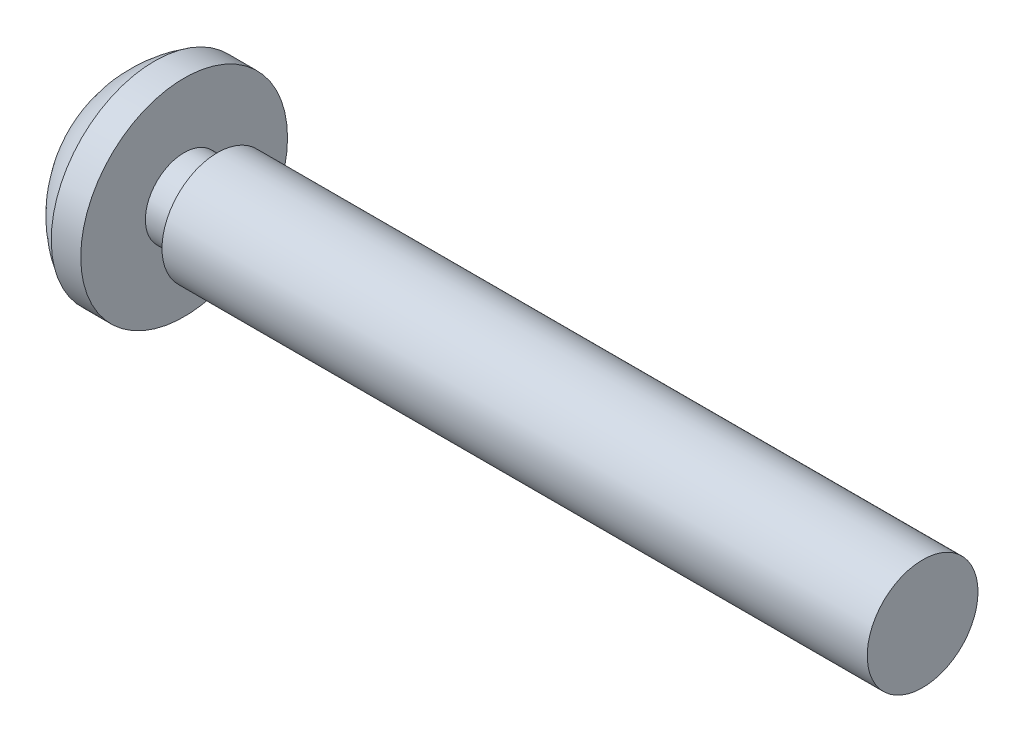
ISO-10303-21;
HEADER;
FILE_DESCRIPTION(('STEP AP214'),'2;1');
FILE_NAME('part.step','',(''),(''),'','','');
FILE_SCHEMA(('AUTOMOTIVE_DESIGN { 1 0 10303 214 1 1 1 1 }'));
ENDSEC;
DATA;
#1=APPLICATION_CONTEXT('core data for automotive mechanical design processes');
#2=APPLICATION_PROTOCOL_DEFINITION('international standard','automotive_design',2000,#1);
#3=PRODUCT_CONTEXT('',#1,'mechanical');
#4=PRODUCT('Part','Part','',(#3));
#5=PRODUCT_RELATED_PRODUCT_CATEGORY('part','',(#4));
#6=PRODUCT_DEFINITION_FORMATION('','',#4);
#7=PRODUCT_DEFINITION_CONTEXT('part definition',#1,'design');
#8=PRODUCT_DEFINITION('design','',#6,#7);
#9=PRODUCT_DEFINITION_SHAPE('','',#8);
#10=(LENGTH_UNIT() NAMED_UNIT(*) SI_UNIT(.MILLI.,.METRE.));
#11=(NAMED_UNIT(*) PLANE_ANGLE_UNIT() SI_UNIT($,.RADIAN.));
#12=(NAMED_UNIT(*) SI_UNIT($,.STERADIAN.) SOLID_ANGLE_UNIT());
#13=UNCERTAINTY_MEASURE_WITH_UNIT(LENGTH_MEASURE(1.E-05),#10,'distance_accuracy_value','');
#14=(GEOMETRIC_REPRESENTATION_CONTEXT(3) GLOBAL_UNCERTAINTY_ASSIGNED_CONTEXT((#13)) GLOBAL_UNIT_ASSIGNED_CONTEXT((#10,
#11,#12)) REPRESENTATION_CONTEXT('',''));
#15=CARTESIAN_POINT('',(0.,0.,0.));
#16=DIRECTION('',(0.,0.,1.));
#17=DIRECTION('',(1.,0.,0.));
#18=AXIS2_PLACEMENT_3D('',#15,#16,#17);
#19=CARTESIAN_POINT('',(-19.15,0.,0.));
#20=DIRECTION('',(1.,0.,0.));
#21=DIRECTION('',(0.,1.,0.));
#22=AXIS2_PLACEMENT_3D('',#19,#20,#21);
#23=SPHERICAL_SURFACE('',#22,3.25);
#24=CARTESIAN_POINT('',(-20.8,0.,0.));
#25=DIRECTION('',(1.,0.,0.));
#26=DIRECTION('',(0.,0.,-1.));
#27=AXIS2_PLACEMENT_3D('',#24,#25,#26);
#28=CIRCLE('',#27,2.8);
#29=CARTESIAN_POINT('',(-20.8,0.,-2.8));
#30=VERTEX_POINT('',#29);
#31=EDGE_CURVE('E172',#30,#30,#28,.T.);
#32=ORIENTED_EDGE('',*,*,#31,.F.);
#33=EDGE_LOOP('',(#32));
#34=FACE_BOUND('',#33,.T.);
#35=CARTESIAN_POINT('',(-22.3068940289468,0.375000066666674,-0.675199999999999));
#36=CARTESIAN_POINT('',(-22.31039538603,0.374974039787709,-0.658850385121531));
#37=CARTESIAN_POINT('',(-22.3136133722107,0.37631432389268,-0.642432860727959));
#38=CARTESIAN_POINT('',(-22.3193993644706,0.381684853078188,-0.609919694568042));
#39=CARTESIAN_POINT('',(-22.3219670797919,0.385716298547903,-0.593824199743856));
#40=CARTESIAN_POINT('',(-22.3263691557337,0.396434080962598,-0.562405806208291));
#41=CARTESIAN_POINT('',(-22.3282024640236,0.40312420038652,-0.547084043435579));
#42=CARTESIAN_POINT('',(-22.3310682853566,0.418991926287625,-0.517716698727841));
#43=CARTESIAN_POINT('',(-22.3321013161393,0.428167919333055,-0.503670296900031));
#44=CARTESIAN_POINT('',(-22.333317814792,0.448514526561983,-0.477587734148935));
#45=CARTESIAN_POINT('',(-22.3335204359993,0.459633928169651,-0.465512496825722));
#46=CARTESIAN_POINT('',(-22.3331219469987,0.483685195957618,-0.443340514979258));
#47=CARTESIAN_POINT('',(-22.3325207910735,0.496617165195829,-0.43324388303273));
#48=CARTESIAN_POINT('',(-22.3305465495203,0.52375198188587,-0.415414384530053));
#49=CARTESIAN_POINT('',(-22.3291823028179,0.53793873877994,-0.407655989689832));
#50=CARTESIAN_POINT('',(-22.3257316366459,0.567301133586124,-0.39453703708237));
#51=CARTESIAN_POINT('',(-22.3236451638736,0.582476844419147,-0.389176656363358));
#52=CARTESIAN_POINT('',(-22.3192512828636,0.610594589490666,-0.381701859125301));
#53=CARTESIAN_POINT('',(-22.317051373952,0.623446563005218,-0.379176670553307));
#54=CARTESIAN_POINT('',(-22.3122574783827,0.649278469056087,-0.375820322941036));
#55=CARTESIAN_POINT('',(-22.3096640610531,0.662258191795707,-0.37498674113212));
#56=CARTESIAN_POINT('',(-22.3068940289468,0.675199999999999,-0.375000066666674));
#57=B_SPLINE_CURVE_WITH_KNOTS('',3,(#35,#36,#37,#38,#39,#40,#41,#42,#43,#44,#45,#46,#47,#48,#49,
#50,#51,#52,#53,#54,#55,#56),.UNSPECIFIED.,.F.,.F.,(4,2,2,2,2,2,2,2,2,2,4),(0.,
0.0501133292441571,0.100249026425948,0.150456308180251,0.20063108114174,0.249641830902457,
0.298655368418994,0.347112597227158,0.395573403099858,0.435304823461775,0.474979299046477),.UNSPECIFIED.);
#58=CARTESIAN_POINT('',(-22.3069368064629,0.375,-0.675));
#59=VERTEX_POINT('',#58);
#60=CARTESIAN_POINT('',(-22.3069368064629,0.675,-0.375));
#61=VERTEX_POINT('',#60);
#62=EDGE_CURVE('E205',#59,#61,#57,.T.);
#63=ORIENTED_EDGE('',*,*,#62,.T.);
#64=CARTESIAN_POINT('',(-19.15,0.,-0.375));
#65=DIRECTION('',(0.,0.,1.));
#66=DIRECTION('',(1.,0.,0.));
#67=AXIS2_PLACEMENT_3D('',#64,#65,#66);
#68=CIRCLE('',#67,3.22829289253624);
#69=CARTESIAN_POINT('',(-21.8299020504489,1.8,-0.375));
#70=VERTEX_POINT('',#69);
#71=EDGE_CURVE('E11',#61,#70,#68,.F.);
#72=ORIENTED_EDGE('',*,*,#71,.T.);
#73=CARTESIAN_POINT('',(-19.15,1.8,0.));
#74=DIRECTION('',(0.,-1.,0.));
#75=DIRECTION('',(0.,0.,-1.));
#76=AXIS2_PLACEMENT_3D('',#73,#74,#75);
#77=CIRCLE('',#76,2.70601182554696);
#78=CARTESIAN_POINT('',(-21.8299020504489,1.8,0.375));
#79=VERTEX_POINT('',#78);
#80=EDGE_CURVE('E49',#70,#79,#77,.F.);
#81=ORIENTED_EDGE('',*,*,#80,.T.);
#82=CARTESIAN_POINT('',(-19.15,0.,0.375));
#83=DIRECTION('',(0.,0.,-1.));
#84=DIRECTION('',(0.,1.,0.));
#85=AXIS2_PLACEMENT_3D('',#82,#83,#84);
#86=CIRCLE('',#85,3.22829289253624);
#87=CARTESIAN_POINT('',(-22.3069368064629,0.675,0.375));
#88=VERTEX_POINT('',#87);
#89=EDGE_CURVE('E314',#79,#88,#86,.F.);
#90=ORIENTED_EDGE('',*,*,#89,.T.);
#91=CARTESIAN_POINT('',(-22.3068940289468,0.675199999999999,0.375000066666674));
#92=CARTESIAN_POINT('',(-22.31039538603,0.658850385121531,0.374974039787708));
#93=CARTESIAN_POINT('',(-22.3136133722107,0.642432860727959,0.37631432389268));
#94=CARTESIAN_POINT('',(-22.3193993644706,0.609919694568042,0.381684853078188));
#95=CARTESIAN_POINT('',(-22.3219670797919,0.593824199743856,0.385716298547903));
#96=CARTESIAN_POINT('',(-22.3263691557337,0.562405806208291,0.396434080962598));
#97=CARTESIAN_POINT('',(-22.3282024640236,0.547084043435579,0.403124200386519));
#98=CARTESIAN_POINT('',(-22.3310682853566,0.517716698727841,0.418991926287625));
#99=CARTESIAN_POINT('',(-22.3321013161393,0.503670296900031,0.428167919333055));
#100=CARTESIAN_POINT('',(-22.333317814792,0.477587734148935,0.448514526561983));
#101=CARTESIAN_POINT('',(-22.3335204359993,0.465512496825722,0.45963392816965));
#102=CARTESIAN_POINT('',(-22.3331219469987,0.443340514979258,0.483685195957618));
#103=CARTESIAN_POINT('',(-22.3325207910735,0.43324388303273,0.496617165195829));
#104=CARTESIAN_POINT('',(-22.3305465495203,0.415414384530053,0.52375198188587));
#105=CARTESIAN_POINT('',(-22.3291823028179,0.407655989689833,0.537938738779939));
#106=CARTESIAN_POINT('',(-22.3257316366459,0.394537037082369,0.567301133586124));
#107=CARTESIAN_POINT('',(-22.3236451638736,0.389176656363358,0.582476844419147));
#108=CARTESIAN_POINT('',(-22.3192512828636,0.381701859125301,0.610594589490666));
#109=CARTESIAN_POINT('',(-22.317051373952,0.379176670553307,0.623446563005218));
#110=CARTESIAN_POINT('',(-22.3122574783827,0.375820322941036,0.649278469056086));
#111=CARTESIAN_POINT('',(-22.3096640610531,0.37498674113212,0.662258191795707));
#112=CARTESIAN_POINT('',(-22.3068940289468,0.375000066666674,0.675199999999999));
#113=B_SPLINE_CURVE_WITH_KNOTS('',3,(#91,#92,#93,#94,#95,#96,#97,#98,#99,#100,#101,#102,#103,
#104,#105,#106,#107,#108,#109,#110,#111,#112),.UNSPECIFIED.,.F.,.F.,(4,2,2,2,2,2,2,2,2,2,4),(0.,
0.0501133292441573,0.100249026425948,0.150456308180251,0.20063108114174,0.249641830902457,
0.298655368418994,0.347112597227158,0.395573403099857,0.435304823461775,0.474979299046478),.UNSPECIFIED.);
#114=CARTESIAN_POINT('',(-22.3069368064629,0.375,0.675));
#115=VERTEX_POINT('',#114);
#116=EDGE_CURVE('E305',#88,#115,#113,.T.);
#117=ORIENTED_EDGE('',*,*,#116,.T.);
#118=CARTESIAN_POINT('',(-19.15,0.375,0.));
#119=DIRECTION('',(0.,-1.,0.));
#120=DIRECTION('',(0.,0.,-1.));
#121=AXIS2_PLACEMENT_3D('',#118,#119,#120);
#122=CIRCLE('',#121,3.22829289253624);
#123=CARTESIAN_POINT('',(-21.8299020504489,0.375,1.8));
#124=VERTEX_POINT('',#123);
#125=EDGE_CURVE('E315',#115,#124,#122,.F.);
#126=ORIENTED_EDGE('',*,*,#125,.T.);
#127=CARTESIAN_POINT('',(-19.15,0.,1.8));
#128=DIRECTION('',(0.,0.,-1.));
#129=DIRECTION('',(-1.,0.,0.));
#130=AXIS2_PLACEMENT_3D('',#127,#128,#129);
#131=CIRCLE('',#130,2.70601182554696);
#132=CARTESIAN_POINT('',(-21.8299020504489,-0.375,1.8));
#133=VERTEX_POINT('',#132);
#134=EDGE_CURVE('E435',#124,#133,#131,.F.);
#135=ORIENTED_EDGE('',*,*,#134,.T.);
#136=CARTESIAN_POINT('',(-19.15,-0.375,0.));
#137=DIRECTION('',(0.,1.,0.));
#138=DIRECTION('',(0.,0.,1.));
#139=AXIS2_PLACEMENT_3D('',#136,#137,#138);
#140=CIRCLE('',#139,3.22829289253624);
#141=CARTESIAN_POINT('',(-22.3069368064629,-0.375,0.675));
#142=VERTEX_POINT('',#141);
#143=EDGE_CURVE('E276',#133,#142,#140,.F.);
#144=ORIENTED_EDGE('',*,*,#143,.T.);
#145=CARTESIAN_POINT('',(-22.3068940289468,-0.375000066666674,0.675199999999999));
#146=CARTESIAN_POINT('',(-22.31039538603,-0.374974039787708,0.658850385121531));
#147=CARTESIAN_POINT('',(-22.3136133722107,-0.37631432389268,0.64243286072796));
#148=CARTESIAN_POINT('',(-22.3193993644706,-0.381684853078188,0.609919694568042));
#149=CARTESIAN_POINT('',(-22.3219670797919,-0.385716298547903,0.593824199743856));
#150=CARTESIAN_POINT('',(-22.3263691557337,-0.396434080962598,0.562405806208291));
#151=CARTESIAN_POINT('',(-22.3282024640236,-0.403124200386519,0.547084043435579));
#152=CARTESIAN_POINT('',(-22.3310682853566,-0.418991926287625,0.517716698727841));
#153=CARTESIAN_POINT('',(-22.3321013161393,-0.428167919333055,0.503670296900031));
#154=CARTESIAN_POINT('',(-22.333317814792,-0.448514526561982,0.477587734148936));
#155=CARTESIAN_POINT('',(-22.3335204359993,-0.45963392816965,0.465512496825722));
#156=CARTESIAN_POINT('',(-22.3331219469987,-0.483685195957618,0.443340514979258));
#157=CARTESIAN_POINT('',(-22.3325207910735,-0.496617165195828,0.43324388303273));
#158=CARTESIAN_POINT('',(-22.3305465495203,-0.52375198188587,0.415414384530054));
#159=CARTESIAN_POINT('',(-22.3291823028179,-0.537938738779939,0.407655989689833));
#160=CARTESIAN_POINT('',(-22.3257316366459,-0.567301133586124,0.394537037082369));
#161=CARTESIAN_POINT('',(-22.3236451638736,-0.582476844419147,0.389176656363358));
#162=CARTESIAN_POINT('',(-22.3192512828636,-0.610594589490666,0.381701859125301));
#163=CARTESIAN_POINT('',(-22.317051373952,-0.623446563005218,0.379176670553306));
#164=CARTESIAN_POINT('',(-22.3122574783827,-0.649278469056087,0.375820322941036));
#165=CARTESIAN_POINT('',(-22.3096640610531,-0.662258191795707,0.37498674113212));
#166=CARTESIAN_POINT('',(-22.3068940289468,-0.675199999999999,0.375000066666674));
#167=B_SPLINE_CURVE_WITH_KNOTS('',3,(#145,#146,#147,#148,#149,#150,#151,#152,#153,#154,#155,
#156,#157,#158,#159,#160,#161,#162,#163,#164,#165,#166),.UNSPECIFIED.,.F.,.F.,(4,2,2,2,2,2,2,2,
2,2,4),(0.,0.050113329244157,0.100249026425948,0.150456308180251,0.200631081141739,
0.249641830902456,0.298655368418994,0.347112597227158,0.395573403099857,0.435304823461776,
0.474979299046479),.UNSPECIFIED.);
#168=CARTESIAN_POINT('',(-22.3069368064629,-0.675,0.375));
#169=VERTEX_POINT('',#168);
#170=EDGE_CURVE('E267',#142,#169,#167,.T.);
#171=ORIENTED_EDGE('',*,*,#170,.T.);
#172=CARTESIAN_POINT('',(-19.15,0.,0.375));
#173=DIRECTION('',(0.,0.,-1.));
#174=DIRECTION('',(-1.,0.,0.));
#175=AXIS2_PLACEMENT_3D('',#172,#173,#174);
#176=CIRCLE('',#175,3.22829289253624);
#177=CARTESIAN_POINT('',(-21.8299020504489,-1.8,0.375));
#178=VERTEX_POINT('',#177);
#179=EDGE_CURVE('E263',#169,#178,#176,.F.);
#180=ORIENTED_EDGE('',*,*,#179,.T.);
#181=CARTESIAN_POINT('',(-19.15,-1.8,0.));
#182=DIRECTION('',(0.,1.,0.));
#183=DIRECTION('',(0.,0.,1.));
#184=AXIS2_PLACEMENT_3D('',#181,#182,#183);
#185=CIRCLE('',#184,2.70601182554696);
#186=CARTESIAN_POINT('',(-21.8299020504489,-1.8,-0.375));
#187=VERTEX_POINT('',#186);
#188=EDGE_CURVE('E259',#178,#187,#185,.F.);
#189=ORIENTED_EDGE('',*,*,#188,.T.);
#190=CARTESIAN_POINT('',(-19.15,0.,-0.375));
#191=DIRECTION('',(0.,0.,1.));
#192=DIRECTION('',(0.,-1.,0.));
#193=AXIS2_PLACEMENT_3D('',#190,#191,#192);
#194=CIRCLE('',#193,3.22829289253624);
#195=CARTESIAN_POINT('',(-22.3069368064629,-0.675,-0.375));
#196=VERTEX_POINT('',#195);
#197=EDGE_CURVE('E254',#187,#196,#194,.F.);
#198=ORIENTED_EDGE('',*,*,#197,.T.);
#199=CARTESIAN_POINT('',(-22.3068940289468,-0.675199999999999,-0.375000066666674));
#200=CARTESIAN_POINT('',(-22.31039538603,-0.658850385121532,-0.374974039787709));
#201=CARTESIAN_POINT('',(-22.3136133722107,-0.64243286072796,-0.37631432389268));
#202=CARTESIAN_POINT('',(-22.3193993644706,-0.609919694568042,-0.381684853078188));
#203=CARTESIAN_POINT('',(-22.3219670797919,-0.593824199743856,-0.385716298547903));
#204=CARTESIAN_POINT('',(-22.3263691557337,-0.562405806208292,-0.396434080962598));
#205=CARTESIAN_POINT('',(-22.3282024640236,-0.547084043435579,-0.403124200386519));
#206=CARTESIAN_POINT('',(-22.3310682853566,-0.517716698727842,-0.418991926287625));
#207=CARTESIAN_POINT('',(-22.3321013161393,-0.503670296900031,-0.428167919333055));
#208=CARTESIAN_POINT('',(-22.333317814792,-0.477587734148936,-0.448514526561982));
#209=CARTESIAN_POINT('',(-22.3335204359993,-0.465512496825722,-0.45963392816965));
#210=CARTESIAN_POINT('',(-22.3331219469987,-0.443340514979258,-0.483685195957618));
#211=CARTESIAN_POINT('',(-22.3325207910735,-0.43324388303273,-0.496617165195828));
#212=CARTESIAN_POINT('',(-22.3305465495203,-0.415414384530054,-0.52375198188587));
#213=CARTESIAN_POINT('',(-22.3291823028179,-0.407655989689833,-0.537938738779939));
#214=CARTESIAN_POINT('',(-22.3257316366459,-0.39453703708237,-0.567301133586124));
#215=CARTESIAN_POINT('',(-22.3236451638736,-0.389176656363358,-0.582476844419147));
#216=CARTESIAN_POINT('',(-22.3192512828636,-0.381701859125301,-0.610594589490666));
#217=CARTESIAN_POINT('',(-22.317051373952,-0.379176670553307,-0.623446563005217));
#218=CARTESIAN_POINT('',(-22.3122574783827,-0.375820322941036,-0.649278469056087));
#219=CARTESIAN_POINT('',(-22.3096640610531,-0.37498674113212,-0.662258191795707));
#220=CARTESIAN_POINT('',(-22.3068940289468,-0.375000066666674,-0.675199999999999));
#221=B_SPLINE_CURVE_WITH_KNOTS('',3,(#199,#200,#201,#202,#203,#204,#205,#206,#207,#208,#209,
#210,#211,#212,#213,#214,#215,#216,#217,#218,#219,#220),.UNSPECIFIED.,.F.,.F.,(4,2,2,2,2,2,2,2,
2,2,4),(0.,0.0501133292441569,0.100249026425948,0.150456308180251,0.200631081141739,
0.249641830902456,0.298655368418994,0.347112597227158,0.395573403099857,0.435304823461775,
0.474979299046478),.UNSPECIFIED.);
#222=CARTESIAN_POINT('',(-22.3069368064629,-0.375,-0.675));
#223=VERTEX_POINT('',#222);
#224=EDGE_CURVE('E245',#196,#223,#221,.T.);
#225=ORIENTED_EDGE('',*,*,#224,.T.);
#226=CARTESIAN_POINT('',(-19.15,-0.375,0.));
#227=DIRECTION('',(0.,1.,0.));
#228=DIRECTION('',(0.,0.,1.));
#229=AXIS2_PLACEMENT_3D('',#226,#227,#228);
#230=CIRCLE('',#229,3.22829289253624);
#231=CARTESIAN_POINT('',(-21.8299020504489,-0.375,-1.8));
#232=VERTEX_POINT('',#231);
#233=EDGE_CURVE('E255',#223,#232,#230,.F.);
#234=ORIENTED_EDGE('',*,*,#233,.T.);
#235=CARTESIAN_POINT('',(-19.15,0.,-1.8));
#236=DIRECTION('',(0.,0.,1.));
#237=DIRECTION('',(1.,0.,0.));
#238=AXIS2_PLACEMENT_3D('',#235,#236,#237);
#239=CIRCLE('',#238,2.70601182554696);
#240=CARTESIAN_POINT('',(-21.8299020504489,0.375,-1.8));
#241=VERTEX_POINT('',#240);
#242=EDGE_CURVE('E428',#232,#241,#239,.F.);
#243=ORIENTED_EDGE('',*,*,#242,.T.);
#244=CARTESIAN_POINT('',(-19.15,0.375,0.));
#245=DIRECTION('',(0.,-1.,0.));
#246=DIRECTION('',(0.,0.,-1.));
#247=AXIS2_PLACEMENT_3D('',#244,#245,#246);
#248=CIRCLE('',#247,3.22829289253624);
#249=EDGE_CURVE('E215',#241,#59,#248,.F.);
#250=ORIENTED_EDGE('',*,*,#249,.T.);
#251=EDGE_LOOP('',(#63,#72,#81,#90,#117,#126,#135,#144,#171,#180,#189,#198,#225,#234,#243,#250));
#252=FACE_BOUND('',#251,.T.);
#253=ADVANCED_FACE('F40',(#34,#252),#23,.T.);
#254=CARTESIAN_POINT('',(0.,0.,0.));
#255=DIRECTION('',(1.,0.,0.));
#256=DIRECTION('',(0.,0.,-1.));
#257=AXIS2_PLACEMENT_3D('',#254,#255,#256);
#258=PLANE('',#257);
#259=CARTESIAN_POINT('',(0.,0.,0.));
#260=DIRECTION('',(1.,0.,0.));
#261=DIRECTION('',(0.,0.,-1.));
#262=AXIS2_PLACEMENT_3D('',#259,#260,#261);
#263=CIRCLE('',#262,1.5);
#264=CARTESIAN_POINT('',(0.,0.,-1.5));
#265=VERTEX_POINT('',#264);
#266=EDGE_CURVE('E201',#265,#265,#263,.T.);
#267=ORIENTED_EDGE('',*,*,#266,.T.);
#268=EDGE_LOOP('',(#267));
#269=FACE_BOUND('',#268,.T.);
#270=ADVANCED_FACE('F42',(#269),#258,.T.);
#271=CARTESIAN_POINT('',(0.,0.,0.));
#272=DIRECTION('',(1.,0.,0.));
#273=DIRECTION('',(0.,0.,-1.));
#274=AXIS2_PLACEMENT_3D('',#271,#272,#273);
#275=CYLINDRICAL_SURFACE('',#274,1.5);
#276=CARTESIAN_POINT('',(-19.1,0.,0.));
#277=DIRECTION('',(1.,0.,0.));
#278=DIRECTION('',(0.,0.,-1.));
#279=AXIS2_PLACEMENT_3D('',#276,#277,#278);
#280=CIRCLE('',#279,1.5);
#281=CARTESIAN_POINT('',(-19.1,0.,-1.5));
#282=VERTEX_POINT('',#281);
#283=EDGE_CURVE('E197',#282,#282,#280,.T.);
#284=ORIENTED_EDGE('',*,*,#283,.T.);
#285=EDGE_LOOP('',(#284));
#286=FACE_BOUND('',#285,.T.);
#287=ORIENTED_EDGE('',*,*,#266,.F.);
#288=EDGE_LOOP('',(#287));
#289=FACE_BOUND('',#288,.T.);
#290=ADVANCED_FACE('F463',(#286,#289),#275,.T.);
#291=CARTESIAN_POINT('',(-19.1,1.5,0.));
#292=DIRECTION('',(-1.,0.,0.));
#293=DIRECTION('',(0.,0.,1.));
#294=AXIS2_PLACEMENT_3D('',#291,#292,#293);
#295=PLANE('',#294);
#296=CARTESIAN_POINT('',(-19.1,0.,0.));
#297=DIRECTION('',(1.,0.,0.));
#298=DIRECTION('',(0.,0.,-1.));
#299=AXIS2_PLACEMENT_3D('',#296,#297,#298);
#300=CIRCLE('',#299,1.05);
#301=CARTESIAN_POINT('',(-19.1,0.,-1.05));
#302=VERTEX_POINT('',#301);
#303=EDGE_CURVE('E193',#302,#302,#300,.T.);
#304=ORIENTED_EDGE('',*,*,#303,.T.);
#305=EDGE_LOOP('',(#304));
#306=FACE_BOUND('',#305,.T.);
#307=ORIENTED_EDGE('',*,*,#283,.F.);
#308=EDGE_LOOP('',(#307));
#309=FACE_BOUND('',#308,.T.);
#310=ADVANCED_FACE('F481',(#306,#309),#295,.T.);
#311=CARTESIAN_POINT('',(0.,0.,0.));
#312=DIRECTION('',(1.,0.,0.));
#313=DIRECTION('',(0.,0.,-1.));
#314=AXIS2_PLACEMENT_3D('',#311,#312,#313);
#315=CYLINDRICAL_SURFACE('',#314,1.05);
#316=CARTESIAN_POINT('',(-20.,0.,0.));
#317=DIRECTION('',(1.,0.,0.));
#318=DIRECTION('',(0.,0.,-1.));
#319=AXIS2_PLACEMENT_3D('',#316,#317,#318);
#320=CIRCLE('',#319,1.05);
#321=CARTESIAN_POINT('',(-20.,0.,-1.05));
#322=VERTEX_POINT('',#321);
#323=EDGE_CURVE('E189',#322,#322,#320,.T.);
#324=ORIENTED_EDGE('',*,*,#323,.T.);
#325=EDGE_LOOP('',(#324));
#326=FACE_BOUND('',#325,.T.);
#327=ORIENTED_EDGE('',*,*,#303,.F.);
#328=EDGE_LOOP('',(#327));
#329=FACE_BOUND('',#328,.T.);
#330=ADVANCED_FACE('F475',(#326,#329),#315,.T.);
#331=CARTESIAN_POINT('',(-20.,1.05,0.));
#332=DIRECTION('',(1.,0.,0.));
#333=DIRECTION('',(0.,0.,-1.));
#334=AXIS2_PLACEMENT_3D('',#331,#332,#333);
#335=PLANE('',#334);
#336=CARTESIAN_POINT('',(-20.,0.,0.));
#337=DIRECTION('',(1.,0.,0.));
#338=DIRECTION('',(0.,0.,-1.));
#339=AXIS2_PLACEMENT_3D('',#336,#337,#338);
#340=CIRCLE('',#339,2.8);
#341=CARTESIAN_POINT('',(-20.,0.,-2.8));
#342=VERTEX_POINT('',#341);
#343=EDGE_CURVE('E179',#342,#342,#340,.T.);
#344=ORIENTED_EDGE('',*,*,#343,.T.);
#345=EDGE_LOOP('',(#344));
#346=FACE_BOUND('',#345,.T.);
#347=ORIENTED_EDGE('',*,*,#323,.F.);
#348=EDGE_LOOP('',(#347));
#349=FACE_BOUND('',#348,.T.);
#350=ADVANCED_FACE('F470',(#346,#349),#335,.T.);
#351=CARTESIAN_POINT('',(0.,0.,0.));
#352=DIRECTION('',(1.,0.,0.));
#353=DIRECTION('',(0.,0.,-1.));
#354=AXIS2_PLACEMENT_3D('',#351,#352,#353);
#355=CYLINDRICAL_SURFACE('',#354,2.8);
#356=ORIENTED_EDGE('',*,*,#31,.T.);
#357=EDGE_LOOP('',(#356));
#358=FACE_BOUND('',#357,.T.);
#359=ORIENTED_EDGE('',*,*,#343,.F.);
#360=EDGE_LOOP('',(#359));
#361=FACE_BOUND('',#360,.T.);
#362=ADVANCED_FACE('F467',(#358,#361),#355,.T.);
#363=CARTESIAN_POINT('',(-21.2,1.8,-0.375));
#364=DIRECTION('',(0.,0.,1.));
#365=DIRECTION('',(1.,0.,0.));
#366=AXIS2_PLACEMENT_3D('',#363,#364,#365);
#367=PLANE('',#366);
#368=DIRECTION('',(-1.,0.,0.));
#369=VECTOR('',#368,1.);
#370=CARTESIAN_POINT('',(-21.2,0.675,-0.375));
#371=LINE('',#370,#369);
#372=CARTESIAN_POINT('',(-21.2,0.675,-0.375));
#373=VERTEX_POINT('',#372);
#374=EDGE_CURVE('E56',#373,#61,#371,.T.);
#375=ORIENTED_EDGE('',*,*,#374,.F.);
#376=DIRECTION('',(0.,1.,0.));
#377=VECTOR('',#376,1.);
#378=CARTESIAN_POINT('',(-21.2,1.8,-0.375));
#379=LINE('',#378,#377);
#380=CARTESIAN_POINT('',(-21.2,1.8,-0.375));
#381=VERTEX_POINT('',#380);
#382=EDGE_CURVE('E159',#373,#381,#379,.T.);
#383=ORIENTED_EDGE('',*,*,#382,.T.);
#384=DIRECTION('',(-1.,0.,0.));
#385=VECTOR('',#384,1.);
#386=CARTESIAN_POINT('',(-21.2,1.8,-0.375));
#387=LINE('',#386,#385);
#388=EDGE_CURVE('E167',#381,#70,#387,.T.);
#389=ORIENTED_EDGE('',*,*,#388,.T.);
#390=ORIENTED_EDGE('',*,*,#71,.F.);
#391=EDGE_LOOP('',(#375,#383,#389,#390));
#392=FACE_BOUND('',#391,.T.);
#393=ADVANCED_FACE('F166',(#392),#367,.T.);
#394=CARTESIAN_POINT('',(-21.2,1.8,-0.375));
#395=DIRECTION('',(0.,-1.,0.));
#396=DIRECTION('',(0.,0.,-1.));
#397=AXIS2_PLACEMENT_3D('',#394,#395,#396);
#398=PLANE('',#397);
#399=ORIENTED_EDGE('',*,*,#388,.F.);
#400=DIRECTION('',(0.,0.,1.));
#401=VECTOR('',#400,1.);
#402=CARTESIAN_POINT('',(-21.2,1.8,-0.375));
#403=LINE('',#402,#401);
#404=CARTESIAN_POINT('',(-21.2,1.8,0.375));
#405=VERTEX_POINT('',#404);
#406=EDGE_CURVE('E155',#381,#405,#403,.T.);
#407=ORIENTED_EDGE('',*,*,#406,.T.);
#408=DIRECTION('',(-1.,0.,0.));
#409=VECTOR('',#408,1.);
#410=CARTESIAN_POINT('',(-21.2,1.8,0.375));
#411=LINE('',#410,#409);
#412=EDGE_CURVE('E173',#405,#79,#411,.T.);
#413=ORIENTED_EDGE('',*,*,#412,.T.);
#414=ORIENTED_EDGE('',*,*,#80,.F.);
#415=EDGE_LOOP('',(#399,#407,#413,#414));
#416=FACE_BOUND('',#415,.T.);
#417=ADVANCED_FACE('F170',(#416),#398,.T.);
#418=CARTESIAN_POINT('',(-21.2,1.8,0.375));
#419=DIRECTION('',(0.,0.,-1.));
#420=DIRECTION('',(0.,1.,0.));
#421=AXIS2_PLACEMENT_3D('',#418,#419,#420);
#422=PLANE('',#421);
#423=ORIENTED_EDGE('',*,*,#412,.F.);
#424=DIRECTION('',(0.,-1.,0.));
#425=VECTOR('',#424,1.);
#426=CARTESIAN_POINT('',(-21.2,1.8,0.375));
#427=LINE('',#426,#425);
#428=CARTESIAN_POINT('',(-21.2,0.675,0.375));
#429=VERTEX_POINT('',#428);
#430=EDGE_CURVE('E161',#405,#429,#427,.T.);
#431=ORIENTED_EDGE('',*,*,#430,.T.);
#432=DIRECTION('',(-1.,0.,0.));
#433=VECTOR('',#432,1.);
#434=CARTESIAN_POINT('',(-21.2,0.675,0.375));
#435=LINE('',#434,#433);
#436=EDGE_CURVE('E182',#429,#88,#435,.T.);
#437=ORIENTED_EDGE('',*,*,#436,.T.);
#438=ORIENTED_EDGE('',*,*,#89,.F.);
#439=EDGE_LOOP('',(#423,#431,#437,#438));
#440=FACE_BOUND('',#439,.T.);
#441=ADVANCED_FACE('F301',(#440),#422,.T.);
#442=CARTESIAN_POINT('',(-21.2,0.675,0.675));
#443=DIRECTION('',(-1.,0.,0.));
#444=DIRECTION('',(0.,0.,1.));
#445=AXIS2_PLACEMENT_3D('',#442,#443,#444);
#446=CYLINDRICAL_SURFACE('',#445,0.3);
#447=ORIENTED_EDGE('',*,*,#436,.F.);
#448=CARTESIAN_POINT('',(-21.2,0.675,0.675));
#449=DIRECTION('',(-1.,0.,0.));
#450=DIRECTION('',(0.,0.,1.));
#451=AXIS2_PLACEMENT_3D('',#448,#449,#450);
#452=CIRCLE('',#451,0.3);
#453=CARTESIAN_POINT('',(-21.2,0.375,0.675));
#454=VERTEX_POINT('',#453);
#455=EDGE_CURVE('E383',#429,#454,#452,.T.);
#456=ORIENTED_EDGE('',*,*,#455,.T.);
#457=DIRECTION('',(-1.,0.,0.));
#458=VECTOR('',#457,1.);
#459=CARTESIAN_POINT('',(-21.2,0.375,0.675));
#460=LINE('',#459,#458);
#461=EDGE_CURVE('E377',#454,#115,#460,.T.);
#462=ORIENTED_EDGE('',*,*,#461,.T.);
#463=ORIENTED_EDGE('',*,*,#116,.F.);
#464=EDGE_LOOP('',(#447,#456,#462,#463));
#465=FACE_BOUND('',#464,.T.);
#466=ADVANCED_FACE('F296',(#465),#446,.T.);
#467=CARTESIAN_POINT('',(-21.2,0.375,0.675));
#468=DIRECTION('',(0.,-1.,0.));
#469=DIRECTION('',(0.,0.,-1.));
#470=AXIS2_PLACEMENT_3D('',#467,#468,#469);
#471=PLANE('',#470);
#472=ORIENTED_EDGE('',*,*,#461,.F.);
#473=DIRECTION('',(0.,0.,1.));
#474=VECTOR('',#473,1.);
#475=CARTESIAN_POINT('',(-21.2,0.375,0.675));
#476=LINE('',#475,#474);
#477=CARTESIAN_POINT('',(-21.2,0.375,1.8));
#478=VERTEX_POINT('',#477);
#479=EDGE_CURVE('E387',#454,#478,#476,.T.);
#480=ORIENTED_EDGE('',*,*,#479,.T.);
#481=DIRECTION('',(-1.,0.,0.));
#482=VECTOR('',#481,1.);
#483=CARTESIAN_POINT('',(-21.2,0.375,1.8));
#484=LINE('',#483,#482);
#485=EDGE_CURVE('E373',#478,#124,#484,.T.);
#486=ORIENTED_EDGE('',*,*,#485,.T.);
#487=ORIENTED_EDGE('',*,*,#125,.F.);
#488=EDGE_LOOP('',(#472,#480,#486,#487));
#489=FACE_BOUND('',#488,.T.);
#490=ADVANCED_FACE('F292',(#489),#471,.T.);
#491=CARTESIAN_POINT('',(-21.2,0.375,1.8));
#492=DIRECTION('',(0.,0.,-1.));
#493=DIRECTION('',(-1.,0.,0.));
#494=AXIS2_PLACEMENT_3D('',#491,#492,#493);
#495=PLANE('',#494);
#496=ORIENTED_EDGE('',*,*,#485,.F.);
#497=DIRECTION('',(0.,-1.,0.));
#498=VECTOR('',#497,1.);
#499=CARTESIAN_POINT('',(-21.2,0.375,1.8));
#500=LINE('',#499,#498);
#501=CARTESIAN_POINT('',(-21.2,-0.375,1.8));
#502=VERTEX_POINT('',#501);
#503=EDGE_CURVE('E393',#478,#502,#500,.T.);
#504=ORIENTED_EDGE('',*,*,#503,.T.);
#505=DIRECTION('',(-1.,0.,0.));
#506=VECTOR('',#505,1.);
#507=CARTESIAN_POINT('',(-21.2,-0.375,1.8));
#508=LINE('',#507,#506);
#509=EDGE_CURVE('E369',#502,#133,#508,.T.);
#510=ORIENTED_EDGE('',*,*,#509,.T.);
#511=ORIENTED_EDGE('',*,*,#134,.F.);
#512=EDGE_LOOP('',(#496,#504,#510,#511));
#513=FACE_BOUND('',#512,.T.);
#514=ADVANCED_FACE('F288',(#513),#495,.T.);
#515=CARTESIAN_POINT('',(-21.2,-0.375,0.675));
#516=DIRECTION('',(0.,1.,0.));
#517=DIRECTION('',(0.,0.,1.));
#518=AXIS2_PLACEMENT_3D('',#515,#516,#517);
#519=PLANE('',#518);
#520=ORIENTED_EDGE('',*,*,#509,.F.);
#521=DIRECTION('',(0.,0.,-1.));
#522=VECTOR('',#521,1.);
#523=CARTESIAN_POINT('',(-21.2,-0.375,0.675));
#524=LINE('',#523,#522);
#525=CARTESIAN_POINT('',(-21.2,-0.375,0.675));
#526=VERTEX_POINT('',#525);
#527=EDGE_CURVE('E400',#502,#526,#524,.T.);
#528=ORIENTED_EDGE('',*,*,#527,.T.);
#529=DIRECTION('',(-1.,0.,0.));
#530=VECTOR('',#529,1.);
#531=CARTESIAN_POINT('',(-21.2,-0.375,0.675));
#532=LINE('',#531,#530);
#533=EDGE_CURVE('E365',#526,#142,#532,.T.);
#534=ORIENTED_EDGE('',*,*,#533,.T.);
#535=ORIENTED_EDGE('',*,*,#143,.F.);
#536=EDGE_LOOP('',(#520,#528,#534,#535));
#537=FACE_BOUND('',#536,.T.);
#538=ADVANCED_FACE('F284',(#537),#519,.T.);
#539=CARTESIAN_POINT('',(-21.2,-0.675,0.675));
#540=DIRECTION('',(-1.,0.,0.));
#541=DIRECTION('',(0.,0.,1.));
#542=AXIS2_PLACEMENT_3D('',#539,#540,#541);
#543=CYLINDRICAL_SURFACE('',#542,0.3);
#544=ORIENTED_EDGE('',*,*,#533,.F.);
#545=CARTESIAN_POINT('',(-21.2,-0.675,0.675));
#546=DIRECTION('',(-1.,0.,0.));
#547=DIRECTION('',(0.,0.,-1.));
#548=AXIS2_PLACEMENT_3D('',#545,#546,#547);
#549=CIRCLE('',#548,0.3);
#550=CARTESIAN_POINT('',(-21.2,-0.675,0.375));
#551=VERTEX_POINT('',#550);
#552=EDGE_CURVE('E402',#526,#551,#549,.T.);
#553=ORIENTED_EDGE('',*,*,#552,.T.);
#554=DIRECTION('',(-1.,0.,0.));
#555=VECTOR('',#554,1.);
#556=CARTESIAN_POINT('',(-21.2,-0.675,0.375));
#557=LINE('',#556,#555);
#558=EDGE_CURVE('E362',#551,#169,#557,.T.);
#559=ORIENTED_EDGE('',*,*,#558,.T.);
#560=ORIENTED_EDGE('',*,*,#170,.F.);
#561=EDGE_LOOP('',(#544,#553,#559,#560));
#562=FACE_BOUND('',#561,.T.);
#563=ADVANCED_FACE('F278',(#562),#543,.T.);
#564=CARTESIAN_POINT('',(-21.2,-0.675,0.375));
#565=DIRECTION('',(0.,0.,-1.));
#566=DIRECTION('',(-1.,0.,0.));
#567=AXIS2_PLACEMENT_3D('',#564,#565,#566);
#568=PLANE('',#567);
#569=ORIENTED_EDGE('',*,*,#558,.F.);
#570=DIRECTION('',(0.,-1.,0.));
#571=VECTOR('',#570,1.);
#572=CARTESIAN_POINT('',(-21.2,-0.675,0.375));
#573=LINE('',#572,#571);
#574=CARTESIAN_POINT('',(-21.2,-1.8,0.375));
#575=VERTEX_POINT('',#574);
#576=EDGE_CURVE('E405',#551,#575,#573,.T.);
#577=ORIENTED_EDGE('',*,*,#576,.T.);
#578=DIRECTION('',(-1.,0.,0.));
#579=VECTOR('',#578,1.);
#580=CARTESIAN_POINT('',(-21.2,-1.8,0.375));
#581=LINE('',#580,#579);
#582=EDGE_CURVE('E358',#575,#178,#581,.T.);
#583=ORIENTED_EDGE('',*,*,#582,.T.);
#584=ORIENTED_EDGE('',*,*,#179,.F.);
#585=EDGE_LOOP('',(#569,#577,#583,#584));
#586=FACE_BOUND('',#585,.T.);
#587=ADVANCED_FACE('F283',(#586),#568,.T.);
#588=CARTESIAN_POINT('',(-21.2,-1.8,-0.375));
#589=DIRECTION('',(0.,1.,0.));
#590=DIRECTION('',(0.,0.,1.));
#591=AXIS2_PLACEMENT_3D('',#588,#589,#590);
#592=PLANE('',#591);
#593=ORIENTED_EDGE('',*,*,#582,.F.);
#594=DIRECTION('',(0.,0.,-1.));
#595=VECTOR('',#594,1.);
#596=CARTESIAN_POINT('',(-21.2,-1.8,-0.375));
#597=LINE('',#596,#595);
#598=CARTESIAN_POINT('',(-21.2,-1.8,-0.375));
#599=VERTEX_POINT('',#598);
#600=EDGE_CURVE('E408',#575,#599,#597,.T.);
#601=ORIENTED_EDGE('',*,*,#600,.T.);
#602=DIRECTION('',(-1.,0.,0.));
#603=VECTOR('',#602,1.);
#604=CARTESIAN_POINT('',(-21.2,-1.8,-0.375));
#605=LINE('',#604,#603);
#606=EDGE_CURVE('E354',#599,#187,#605,.T.);
#607=ORIENTED_EDGE('',*,*,#606,.T.);
#608=ORIENTED_EDGE('',*,*,#188,.F.);
#609=EDGE_LOOP('',(#593,#601,#607,#608));
#610=FACE_BOUND('',#609,.T.);
#611=ADVANCED_FACE('F451',(#610),#592,.T.);
#612=CARTESIAN_POINT('',(-21.2,-0.675,-0.375));
#613=DIRECTION('',(0.,0.,1.));
#614=DIRECTION('',(0.,-1.,0.));
#615=AXIS2_PLACEMENT_3D('',#612,#613,#614);
#616=PLANE('',#615);
#617=ORIENTED_EDGE('',*,*,#606,.F.);
#618=DIRECTION('',(0.,1.,0.));
#619=VECTOR('',#618,1.);
#620=CARTESIAN_POINT('',(-21.2,-0.675,-0.375));
#621=LINE('',#620,#619);
#622=CARTESIAN_POINT('',(-21.2,-0.675,-0.375));
#623=VERTEX_POINT('',#622);
#624=EDGE_CURVE('E410',#599,#623,#621,.T.);
#625=ORIENTED_EDGE('',*,*,#624,.T.);
#626=DIRECTION('',(-1.,0.,0.));
#627=VECTOR('',#626,1.);
#628=CARTESIAN_POINT('',(-21.2,-0.675,-0.375));
#629=LINE('',#628,#627);
#630=EDGE_CURVE('E350',#623,#196,#629,.T.);
#631=ORIENTED_EDGE('',*,*,#630,.T.);
#632=ORIENTED_EDGE('',*,*,#197,.F.);
#633=EDGE_LOOP('',(#617,#625,#631,#632));
#634=FACE_BOUND('',#633,.T.);
#635=ADVANCED_FACE('F241',(#634),#616,.T.);
#636=CARTESIAN_POINT('',(-21.2,-0.675,-0.675));
#637=DIRECTION('',(-1.,0.,0.));
#638=DIRECTION('',(0.,0.,1.));
#639=AXIS2_PLACEMENT_3D('',#636,#637,#638);
#640=CYLINDRICAL_SURFACE('',#639,0.3);
#641=ORIENTED_EDGE('',*,*,#630,.F.);
#642=CARTESIAN_POINT('',(-21.2,-0.675,-0.675));
#643=DIRECTION('',(-1.,0.,0.));
#644=DIRECTION('',(0.,0.,1.));
#645=AXIS2_PLACEMENT_3D('',#642,#643,#644);
#646=CIRCLE('',#645,0.3);
#647=CARTESIAN_POINT('',(-21.2,-0.375,-0.675));
#648=VERTEX_POINT('',#647);
#649=EDGE_CURVE('E413',#623,#648,#646,.T.);
#650=ORIENTED_EDGE('',*,*,#649,.T.);
#651=DIRECTION('',(-1.,0.,0.));
#652=VECTOR('',#651,1.);
#653=CARTESIAN_POINT('',(-21.2,-0.375,-0.675));
#654=LINE('',#653,#652);
#655=EDGE_CURVE('E346',#648,#223,#654,.T.);
#656=ORIENTED_EDGE('',*,*,#655,.T.);
#657=ORIENTED_EDGE('',*,*,#224,.F.);
#658=EDGE_LOOP('',(#641,#650,#656,#657));
#659=FACE_BOUND('',#658,.T.);
#660=ADVANCED_FACE('F236',(#659),#640,.T.);
#661=CARTESIAN_POINT('',(-21.2,-0.375,-1.8));
#662=DIRECTION('',(0.,1.,0.));
#663=DIRECTION('',(0.,0.,1.));
#664=AXIS2_PLACEMENT_3D('',#661,#662,#663);
#665=PLANE('',#664);
#666=ORIENTED_EDGE('',*,*,#655,.F.);
#667=DIRECTION('',(0.,0.,-1.));
#668=VECTOR('',#667,1.);
#669=CARTESIAN_POINT('',(-21.2,-0.375,-1.8));
#670=LINE('',#669,#668);
#671=CARTESIAN_POINT('',(-21.2,-0.375,-1.8));
#672=VERTEX_POINT('',#671);
#673=EDGE_CURVE('E416',#648,#672,#670,.T.);
#674=ORIENTED_EDGE('',*,*,#673,.T.);
#675=DIRECTION('',(-1.,0.,0.));
#676=VECTOR('',#675,1.);
#677=CARTESIAN_POINT('',(-21.2,-0.375,-1.8));
#678=LINE('',#677,#676);
#679=EDGE_CURVE('E337',#672,#232,#678,.T.);
#680=ORIENTED_EDGE('',*,*,#679,.T.);
#681=ORIENTED_EDGE('',*,*,#233,.F.);
#682=EDGE_LOOP('',(#666,#674,#680,#681));
#683=FACE_BOUND('',#682,.T.);
#684=ADVANCED_FACE('F232',(#683),#665,.T.);
#685=CARTESIAN_POINT('',(-21.2,0.375,-1.8));
#686=DIRECTION('',(0.,0.,1.));
#687=DIRECTION('',(1.,0.,0.));
#688=AXIS2_PLACEMENT_3D('',#685,#686,#687);
#689=PLANE('',#688);
#690=ORIENTED_EDGE('',*,*,#679,.F.);
#691=DIRECTION('',(0.,1.,0.));
#692=VECTOR('',#691,1.);
#693=CARTESIAN_POINT('',(-21.2,0.375,-1.8));
#694=LINE('',#693,#692);
#695=CARTESIAN_POINT('',(-21.2,0.375,-1.8));
#696=VERTEX_POINT('',#695);
#697=EDGE_CURVE('E419',#672,#696,#694,.T.);
#698=ORIENTED_EDGE('',*,*,#697,.T.);
#699=DIRECTION('',(-1.,0.,0.));
#700=VECTOR('',#699,1.);
#701=CARTESIAN_POINT('',(-21.2,0.375,-1.8));
#702=LINE('',#701,#700);
#703=EDGE_CURVE('E332',#696,#241,#702,.T.);
#704=ORIENTED_EDGE('',*,*,#703,.T.);
#705=ORIENTED_EDGE('',*,*,#242,.F.);
#706=EDGE_LOOP('',(#690,#698,#704,#705));
#707=FACE_BOUND('',#706,.T.);
#708=ADVANCED_FACE('F228',(#707),#689,.T.);
#709=CARTESIAN_POINT('',(-21.2,0.375,-1.8));
#710=DIRECTION('',(0.,-1.,0.));
#711=DIRECTION('',(0.,0.,-1.));
#712=AXIS2_PLACEMENT_3D('',#709,#710,#711);
#713=PLANE('',#712);
#714=ORIENTED_EDGE('',*,*,#703,.F.);
#715=DIRECTION('',(0.,0.,1.));
#716=VECTOR('',#715,1.);
#717=CARTESIAN_POINT('',(-21.2,0.375,-1.8));
#718=LINE('',#717,#716);
#719=CARTESIAN_POINT('',(-21.2,0.375,-0.675));
#720=VERTEX_POINT('',#719);
#721=EDGE_CURVE('E330',#696,#720,#718,.T.);
#722=ORIENTED_EDGE('',*,*,#721,.T.);
#723=DIRECTION('',(-1.,0.,0.));
#724=VECTOR('',#723,1.);
#725=CARTESIAN_POINT('',(-21.2,0.375,-0.675));
#726=LINE('',#725,#724);
#727=EDGE_CURVE('E326',#720,#59,#726,.T.);
#728=ORIENTED_EDGE('',*,*,#727,.T.);
#729=ORIENTED_EDGE('',*,*,#249,.F.);
#730=EDGE_LOOP('',(#714,#722,#728,#729));
#731=FACE_BOUND('',#730,.T.);
#732=ADVANCED_FACE('F225',(#731),#713,.T.);
#733=CARTESIAN_POINT('',(-21.2,0.675,-0.675));
#734=DIRECTION('',(-1.,0.,0.));
#735=DIRECTION('',(0.,0.,1.));
#736=AXIS2_PLACEMENT_3D('',#733,#734,#735);
#737=CYLINDRICAL_SURFACE('',#736,0.3);
#738=ORIENTED_EDGE('',*,*,#727,.F.);
#739=CARTESIAN_POINT('',(-21.2,0.675,-0.675));
#740=DIRECTION('',(-1.,0.,0.));
#741=DIRECTION('',(0.,0.,1.));
#742=AXIS2_PLACEMENT_3D('',#739,#740,#741);
#743=CIRCLE('',#742,0.3);
#744=EDGE_CURVE('E339',#720,#373,#743,.T.);
#745=ORIENTED_EDGE('',*,*,#744,.T.);
#746=ORIENTED_EDGE('',*,*,#374,.T.);
#747=ORIENTED_EDGE('',*,*,#62,.F.);
#748=EDGE_LOOP('',(#738,#745,#746,#747));
#749=FACE_BOUND('',#748,.T.);
#750=ADVANCED_FACE('F220',(#749),#737,.T.);
#751=CARTESIAN_POINT('',(-21.2,0.675,-0.675));
#752=DIRECTION('',(-1.,0.,0.));
#753=DIRECTION('',(0.,0.,1.));
#754=AXIS2_PLACEMENT_3D('',#751,#752,#753);
#755=PLANE('',#754);
#756=ORIENTED_EDGE('',*,*,#382,.F.);
#757=ORIENTED_EDGE('',*,*,#744,.F.);
#758=ORIENTED_EDGE('',*,*,#721,.F.);
#759=ORIENTED_EDGE('',*,*,#697,.F.);
#760=ORIENTED_EDGE('',*,*,#673,.F.);
#761=ORIENTED_EDGE('',*,*,#649,.F.);
#762=ORIENTED_EDGE('',*,*,#624,.F.);
#763=ORIENTED_EDGE('',*,*,#600,.F.);
#764=ORIENTED_EDGE('',*,*,#576,.F.);
#765=ORIENTED_EDGE('',*,*,#552,.F.);
#766=ORIENTED_EDGE('',*,*,#527,.F.);
#767=ORIENTED_EDGE('',*,*,#503,.F.);
#768=ORIENTED_EDGE('',*,*,#479,.F.);
#769=ORIENTED_EDGE('',*,*,#455,.F.);
#770=ORIENTED_EDGE('',*,*,#430,.F.);
#771=ORIENTED_EDGE('',*,*,#406,.F.);
#772=EDGE_LOOP('',(#756,#757,#758,#759,#760,#761,#762,#763,#764,#765,#766,#767,#768,#769,#770,#771));
#773=FACE_BOUND('',#772,.T.);
#774=ADVANCED_FACE('F157',(#773),#755,.T.);
#775=CLOSED_SHELL('',(#253,#270,#290,#310,#330,#350,#362,#393,#417,#441,#466,#490,#514,#538,
#563,#587,#611,#635,#660,#684,#708,#732,#750,#774));
#776=MANIFOLD_SOLID_BREP('B2',#775);
#777=ADVANCED_BREP_SHAPE_REPRESENTATION('',(#18,#776),#14);
#778=SHAPE_DEFINITION_REPRESENTATION(#9,#777);
ENDSEC;
END-ISO-10303-21;
